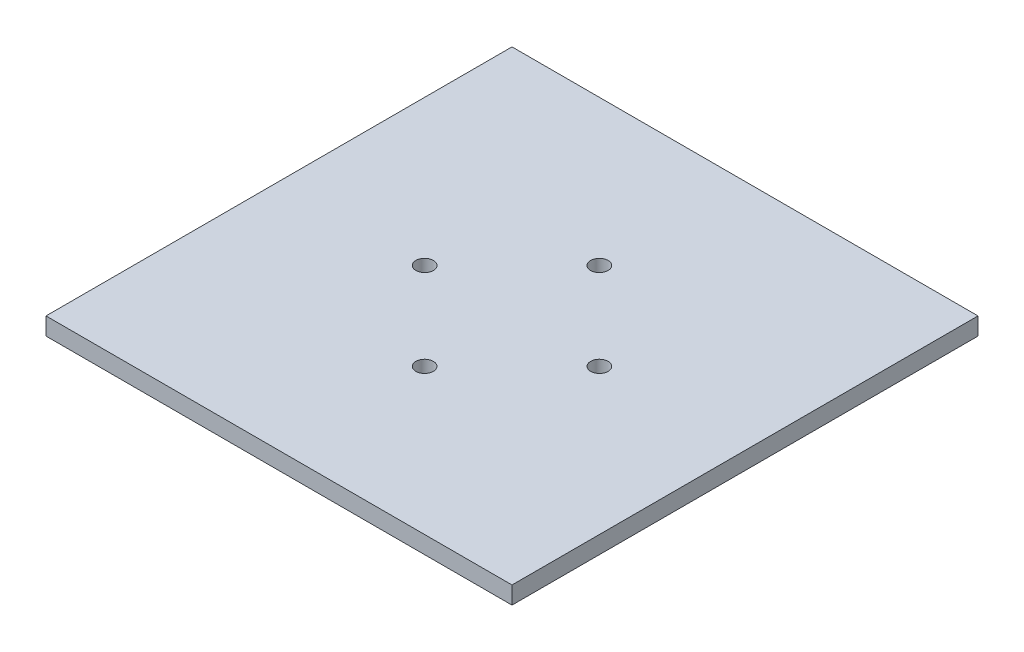
ISO-10303-21;
HEADER;
FILE_DESCRIPTION(('STEP AP214'),'2;1');
FILE_NAME('part.step','',(''),(''),'','','');
FILE_SCHEMA(('AUTOMOTIVE_DESIGN { 1 0 10303 214 1 1 1 1 }'));
ENDSEC;
DATA;
#1=APPLICATION_CONTEXT('core data for automotive mechanical design processes');
#2=APPLICATION_PROTOCOL_DEFINITION('international standard','automotive_design',2000,#1);
#3=PRODUCT_CONTEXT('',#1,'mechanical');
#4=PRODUCT('Part','Part','',(#3));
#5=PRODUCT_RELATED_PRODUCT_CATEGORY('part','',(#4));
#6=PRODUCT_DEFINITION_FORMATION('','',#4);
#7=PRODUCT_DEFINITION_CONTEXT('part definition',#1,'design');
#8=PRODUCT_DEFINITION('design','',#6,#7);
#9=PRODUCT_DEFINITION_SHAPE('','',#8);
#10=(LENGTH_UNIT() NAMED_UNIT(*) SI_UNIT(.MILLI.,.METRE.));
#11=(NAMED_UNIT(*) PLANE_ANGLE_UNIT() SI_UNIT($,.RADIAN.));
#12=(NAMED_UNIT(*) SI_UNIT($,.STERADIAN.) SOLID_ANGLE_UNIT());
#13=UNCERTAINTY_MEASURE_WITH_UNIT(LENGTH_MEASURE(1.E-05),#10,'distance_accuracy_value','');
#14=(GEOMETRIC_REPRESENTATION_CONTEXT(3) GLOBAL_UNCERTAINTY_ASSIGNED_CONTEXT((#13)) GLOBAL_UNIT_ASSIGNED_CONTEXT((#10,
#11,#12)) REPRESENTATION_CONTEXT('',''));
#15=CARTESIAN_POINT('',(0.,0.,0.));
#16=DIRECTION('',(0.,0.,1.));
#17=DIRECTION('',(1.,0.,0.));
#18=AXIS2_PLACEMENT_3D('',#15,#16,#17);
#19=CARTESIAN_POINT('',(0.,3.,0.));
#20=DIRECTION('',(0.,-1.,0.));
#21=DIRECTION('',(0.,0.,-1.));
#22=AXIS2_PLACEMENT_3D('',#19,#20,#21);
#23=PLANE('',#22);
#24=DIRECTION('',(0.,0.,-1.));
#25=VECTOR('',#24,1.);
#26=CARTESIAN_POINT('',(40.,3.,40.));
#27=LINE('',#26,#25);
#28=CARTESIAN_POINT('',(40.,3.,40.));
#29=VERTEX_POINT('',#28);
#30=CARTESIAN_POINT('',(40.,3.,-40.));
#31=VERTEX_POINT('',#30);
#32=EDGE_CURVE('E92',#29,#31,#27,.T.);
#33=ORIENTED_EDGE('',*,*,#32,.T.);
#34=DIRECTION('',(-1.,0.,0.));
#35=VECTOR('',#34,1.);
#36=CARTESIAN_POINT('',(-40.,3.,-40.));
#37=LINE('',#36,#35);
#38=CARTESIAN_POINT('',(-40.,3.,-40.));
#39=VERTEX_POINT('',#38);
#40=EDGE_CURVE('E87',#31,#39,#37,.T.);
#41=ORIENTED_EDGE('',*,*,#40,.T.);
#42=DIRECTION('',(0.,0.,1.));
#43=VECTOR('',#42,1.);
#44=CARTESIAN_POINT('',(-40.,3.,40.));
#45=LINE('',#44,#43);
#46=CARTESIAN_POINT('',(-40.,3.,40.));
#47=VERTEX_POINT('',#46);
#48=EDGE_CURVE('E90',#39,#47,#45,.T.);
#49=ORIENTED_EDGE('',*,*,#48,.T.);
#50=DIRECTION('',(1.,0.,0.));
#51=VECTOR('',#50,1.);
#52=CARTESIAN_POINT('',(-40.,3.,40.));
#53=LINE('',#52,#51);
#54=EDGE_CURVE('E57',#47,#29,#53,.T.);
#55=ORIENTED_EDGE('',*,*,#54,.T.);
#56=EDGE_LOOP('',(#33,#41,#49,#55));
#57=FACE_BOUND('',#56,.T.);
#58=CARTESIAN_POINT('',(0.,3.,-15.));
#59=DIRECTION('',(0.,1.,0.));
#60=DIRECTION('',(0.,0.,1.));
#61=AXIS2_PLACEMENT_3D('',#58,#59,#60);
#62=CIRCLE('',#61,1.5);
#63=CARTESIAN_POINT('',(0.,3.,-13.5));
#64=VERTEX_POINT('',#63);
#65=EDGE_CURVE('E112',#64,#64,#62,.T.);
#66=ORIENTED_EDGE('',*,*,#65,.F.);
#67=EDGE_LOOP('',(#66));
#68=FACE_BOUND('',#67,.T.);
#69=CARTESIAN_POINT('',(15.,3.,0.));
#70=DIRECTION('',(0.,1.,0.));
#71=DIRECTION('',(0.,0.,1.));
#72=AXIS2_PLACEMENT_3D('',#69,#70,#71);
#73=CIRCLE('',#72,1.5);
#74=CARTESIAN_POINT('',(15.,3.,1.50000000000005));
#75=VERTEX_POINT('',#74);
#76=EDGE_CURVE('E134',#75,#75,#73,.T.);
#77=ORIENTED_EDGE('',*,*,#76,.F.);
#78=EDGE_LOOP('',(#77));
#79=FACE_BOUND('',#78,.T.);
#80=CARTESIAN_POINT('',(8.44626461585417E-13,3.,15.));
#81=DIRECTION('',(0.,1.,0.));
#82=DIRECTION('',(0.,0.,1.));
#83=AXIS2_PLACEMENT_3D('',#80,#81,#82);
#84=CIRCLE('',#83,1.50000000000091);
#85=CARTESIAN_POINT('',(8.44626461585417E-13,3.,16.5000000000009));
#86=VERTEX_POINT('',#85);
#87=EDGE_CURVE('E142',#86,#86,#84,.T.);
#88=ORIENTED_EDGE('',*,*,#87,.F.);
#89=EDGE_LOOP('',(#88));
#90=FACE_BOUND('',#89,.T.);
#91=CARTESIAN_POINT('',(-15.,3.,-1.57116660247941E-13));
#92=DIRECTION('',(0.,1.,0.));
#93=DIRECTION('',(0.,0.,1.));
#94=AXIS2_PLACEMENT_3D('',#91,#92,#93);
#95=CIRCLE('',#94,1.5);
#96=CARTESIAN_POINT('',(-15.,3.,1.49999999999984));
#97=VERTEX_POINT('',#96);
#98=EDGE_CURVE('E150',#97,#97,#95,.T.);
#99=ORIENTED_EDGE('',*,*,#98,.F.);
#100=EDGE_LOOP('',(#99));
#101=FACE_BOUND('',#100,.T.);
#102=ADVANCED_FACE('F39',(#57,#68,#79,#90,#101),#23,.F.);
#103=CARTESIAN_POINT('',(0.,0.,0.));
#104=DIRECTION('',(0.,-1.,0.));
#105=DIRECTION('',(0.,0.,-1.));
#106=AXIS2_PLACEMENT_3D('',#103,#104,#105);
#107=PLANE('',#106);
#108=CARTESIAN_POINT('',(8.44626461585417E-13,0.,15.));
#109=DIRECTION('',(0.,1.,0.));
#110=DIRECTION('',(0.,0.,1.));
#111=AXIS2_PLACEMENT_3D('',#108,#109,#110);
#112=CIRCLE('',#111,1.50000000000091);
#113=CARTESIAN_POINT('',(8.44626461585417E-13,0.,16.5000000000009));
#114=VERTEX_POINT('',#113);
#115=EDGE_CURVE('E146',#114,#114,#112,.T.);
#116=ORIENTED_EDGE('',*,*,#115,.T.);
#117=EDGE_LOOP('',(#116));
#118=FACE_BOUND('',#117,.T.);
#119=CARTESIAN_POINT('',(0.,0.,-15.));
#120=DIRECTION('',(0.,1.,0.));
#121=DIRECTION('',(0.,0.,1.));
#122=AXIS2_PLACEMENT_3D('',#119,#120,#121);
#123=CIRCLE('',#122,1.5);
#124=CARTESIAN_POINT('',(0.,0.,-13.5));
#125=VERTEX_POINT('',#124);
#126=EDGE_CURVE('E130',#125,#125,#123,.T.);
#127=ORIENTED_EDGE('',*,*,#126,.T.);
#128=EDGE_LOOP('',(#127));
#129=FACE_BOUND('',#128,.T.);
#130=DIRECTION('',(0.,0.,-1.));
#131=VECTOR('',#130,1.);
#132=CARTESIAN_POINT('',(40.,0.,40.));
#133=LINE('',#132,#131);
#134=CARTESIAN_POINT('',(40.,0.,40.));
#135=VERTEX_POINT('',#134);
#136=CARTESIAN_POINT('',(40.,0.,-40.));
#137=VERTEX_POINT('',#136);
#138=EDGE_CURVE('E108',#135,#137,#133,.T.);
#139=ORIENTED_EDGE('',*,*,#138,.F.);
#140=DIRECTION('',(1.,0.,0.));
#141=VECTOR('',#140,1.);
#142=CARTESIAN_POINT('',(-40.,0.,40.));
#143=LINE('',#142,#141);
#144=CARTESIAN_POINT('',(-40.,0.,40.));
#145=VERTEX_POINT('',#144);
#146=EDGE_CURVE('E80',#145,#135,#143,.T.);
#147=ORIENTED_EDGE('',*,*,#146,.F.);
#148=DIRECTION('',(0.,0.,1.));
#149=VECTOR('',#148,1.);
#150=CARTESIAN_POINT('',(-40.,0.,40.));
#151=LINE('',#150,#149);
#152=CARTESIAN_POINT('',(-40.,0.,-40.));
#153=VERTEX_POINT('',#152);
#154=EDGE_CURVE('E74',#153,#145,#151,.T.);
#155=ORIENTED_EDGE('',*,*,#154,.F.);
#156=DIRECTION('',(-1.,0.,0.));
#157=VECTOR('',#156,1.);
#158=CARTESIAN_POINT('',(-40.,0.,-40.));
#159=LINE('',#158,#157);
#160=EDGE_CURVE('E97',#137,#153,#159,.T.);
#161=ORIENTED_EDGE('',*,*,#160,.F.);
#162=EDGE_LOOP('',(#139,#147,#155,#161));
#163=FACE_BOUND('',#162,.T.);
#164=CARTESIAN_POINT('',(15.,0.,0.));
#165=DIRECTION('',(0.,1.,0.));
#166=DIRECTION('',(0.,0.,1.));
#167=AXIS2_PLACEMENT_3D('',#164,#165,#166);
#168=CIRCLE('',#167,1.5);
#169=CARTESIAN_POINT('',(15.,0.,1.50000000000005));
#170=VERTEX_POINT('',#169);
#171=EDGE_CURVE('E138',#170,#170,#168,.T.);
#172=ORIENTED_EDGE('',*,*,#171,.T.);
#173=EDGE_LOOP('',(#172));
#174=FACE_BOUND('',#173,.T.);
#175=CARTESIAN_POINT('',(-15.,0.,-1.57116660247941E-13));
#176=DIRECTION('',(0.,1.,0.));
#177=DIRECTION('',(0.,0.,1.));
#178=AXIS2_PLACEMENT_3D('',#175,#176,#177);
#179=CIRCLE('',#178,1.5);
#180=CARTESIAN_POINT('',(-15.,0.,1.49999999999984));
#181=VERTEX_POINT('',#180);
#182=EDGE_CURVE('E154',#181,#181,#179,.T.);
#183=ORIENTED_EDGE('',*,*,#182,.T.);
#184=EDGE_LOOP('',(#183));
#185=FACE_BOUND('',#184,.T.);
#186=ADVANCED_FACE('F125',(#118,#129,#163,#174,#185),#107,.T.);
#187=CARTESIAN_POINT('',(40.,3.,40.));
#188=DIRECTION('',(-1.,0.,0.));
#189=DIRECTION('',(0.,0.,1.));
#190=AXIS2_PLACEMENT_3D('',#187,#188,#189);
#191=PLANE('',#190);
#192=ORIENTED_EDGE('',*,*,#138,.T.);
#193=DIRECTION('',(0.,-1.,0.));
#194=VECTOR('',#193,1.);
#195=CARTESIAN_POINT('',(40.,3.,-40.));
#196=LINE('',#195,#194);
#197=EDGE_CURVE('E11',#31,#137,#196,.T.);
#198=ORIENTED_EDGE('',*,*,#197,.F.);
#199=ORIENTED_EDGE('',*,*,#32,.F.);
#200=DIRECTION('',(0.,-1.,0.));
#201=VECTOR('',#200,1.);
#202=CARTESIAN_POINT('',(40.,3.,40.));
#203=LINE('',#202,#201);
#204=EDGE_CURVE('E104',#29,#135,#203,.T.);
#205=ORIENTED_EDGE('',*,*,#204,.T.);
#206=EDGE_LOOP('',(#192,#198,#199,#205));
#207=FACE_BOUND('',#206,.T.);
#208=ADVANCED_FACE('F41',(#207),#191,.F.);
#209=CARTESIAN_POINT('',(-40.,3.,-40.));
#210=DIRECTION('',(0.,0.,1.));
#211=DIRECTION('',(1.,0.,0.));
#212=AXIS2_PLACEMENT_3D('',#209,#210,#211);
#213=PLANE('',#212);
#214=ORIENTED_EDGE('',*,*,#160,.T.);
#215=DIRECTION('',(0.,-1.,0.));
#216=VECTOR('',#215,1.);
#217=CARTESIAN_POINT('',(-40.,3.,-40.));
#218=LINE('',#217,#216);
#219=EDGE_CURVE('E49',#39,#153,#218,.T.);
#220=ORIENTED_EDGE('',*,*,#219,.F.);
#221=ORIENTED_EDGE('',*,*,#40,.F.);
#222=ORIENTED_EDGE('',*,*,#197,.T.);
#223=EDGE_LOOP('',(#214,#220,#221,#222));
#224=FACE_BOUND('',#223,.T.);
#225=ADVANCED_FACE('F96',(#224),#213,.F.);
#226=CARTESIAN_POINT('',(-40.,3.,40.));
#227=DIRECTION('',(1.,0.,0.));
#228=DIRECTION('',(0.,0.,-1.));
#229=AXIS2_PLACEMENT_3D('',#226,#227,#228);
#230=PLANE('',#229);
#231=ORIENTED_EDGE('',*,*,#154,.T.);
#232=DIRECTION('',(0.,-1.,0.));
#233=VECTOR('',#232,1.);
#234=CARTESIAN_POINT('',(-40.,3.,40.));
#235=LINE('',#234,#233);
#236=EDGE_CURVE('E99',#47,#145,#235,.T.);
#237=ORIENTED_EDGE('',*,*,#236,.F.);
#238=ORIENTED_EDGE('',*,*,#48,.F.);
#239=ORIENTED_EDGE('',*,*,#219,.T.);
#240=EDGE_LOOP('',(#231,#237,#238,#239));
#241=FACE_BOUND('',#240,.T.);
#242=ADVANCED_FACE('F100',(#241),#230,.F.);
#243=CARTESIAN_POINT('',(-40.,3.,40.));
#244=DIRECTION('',(0.,0.,-1.));
#245=DIRECTION('',(-1.,0.,0.));
#246=AXIS2_PLACEMENT_3D('',#243,#244,#245);
#247=PLANE('',#246);
#248=ORIENTED_EDGE('',*,*,#146,.T.);
#249=ORIENTED_EDGE('',*,*,#204,.F.);
#250=ORIENTED_EDGE('',*,*,#54,.F.);
#251=ORIENTED_EDGE('',*,*,#236,.T.);
#252=EDGE_LOOP('',(#248,#249,#250,#251));
#253=FACE_BOUND('',#252,.T.);
#254=ADVANCED_FACE('F122',(#253),#247,.F.);
#255=CARTESIAN_POINT('',(0.,3.,-15.));
#256=DIRECTION('',(0.,-1.,0.));
#257=DIRECTION('',(0.,0.,-1.));
#258=AXIS2_PLACEMENT_3D('',#255,#256,#257);
#259=CYLINDRICAL_SURFACE('',#258,1.5);
#260=ORIENTED_EDGE('',*,*,#65,.T.);
#261=EDGE_LOOP('',(#260));
#262=FACE_BOUND('',#261,.T.);
#263=ORIENTED_EDGE('',*,*,#126,.F.);
#264=EDGE_LOOP('',(#263));
#265=FACE_BOUND('',#264,.T.);
#266=ADVANCED_FACE('F173',(#262,#265),#259,.F.);
#267=CARTESIAN_POINT('',(15.,3.,0.));
#268=DIRECTION('',(0.,-1.,0.));
#269=DIRECTION('',(0.,0.,-1.));
#270=AXIS2_PLACEMENT_3D('',#267,#268,#269);
#271=CYLINDRICAL_SURFACE('',#270,1.5);
#272=ORIENTED_EDGE('',*,*,#76,.T.);
#273=EDGE_LOOP('',(#272));
#274=FACE_BOUND('',#273,.T.);
#275=ORIENTED_EDGE('',*,*,#171,.F.);
#276=EDGE_LOOP('',(#275));
#277=FACE_BOUND('',#276,.T.);
#278=ADVANCED_FACE('F219',(#274,#277),#271,.F.);
#279=CARTESIAN_POINT('',(8.44626461585417E-13,3.,15.));
#280=DIRECTION('',(0.,-1.,0.));
#281=DIRECTION('',(0.,0.,-1.));
#282=AXIS2_PLACEMENT_3D('',#279,#280,#281);
#283=CYLINDRICAL_SURFACE('',#282,1.50000000000091);
#284=ORIENTED_EDGE('',*,*,#87,.T.);
#285=EDGE_LOOP('',(#284));
#286=FACE_BOUND('',#285,.T.);
#287=ORIENTED_EDGE('',*,*,#115,.F.);
#288=EDGE_LOOP('',(#287));
#289=FACE_BOUND('',#288,.T.);
#290=ADVANCED_FACE('F227',(#286,#289),#283,.F.);
#291=CARTESIAN_POINT('',(-15.,3.,-1.57116660247941E-13));
#292=DIRECTION('',(0.,-1.,0.));
#293=DIRECTION('',(0.,0.,-1.));
#294=AXIS2_PLACEMENT_3D('',#291,#292,#293);
#295=CYLINDRICAL_SURFACE('',#294,1.5);
#296=ORIENTED_EDGE('',*,*,#98,.T.);
#297=EDGE_LOOP('',(#296));
#298=FACE_BOUND('',#297,.T.);
#299=ORIENTED_EDGE('',*,*,#182,.F.);
#300=EDGE_LOOP('',(#299));
#301=FACE_BOUND('',#300,.T.);
#302=ADVANCED_FACE('F162',(#298,#301),#295,.F.);
#303=CLOSED_SHELL('',(#102,#186,#208,#225,#242,#254,#266,#278,#290,#302));
#304=MANIFOLD_SOLID_BREP('B2',#303);
#305=ADVANCED_BREP_SHAPE_REPRESENTATION('',(#18,#304),#14);
#306=SHAPE_DEFINITION_REPRESENTATION(#9,#305);
ENDSEC;
END-ISO-10303-21;
